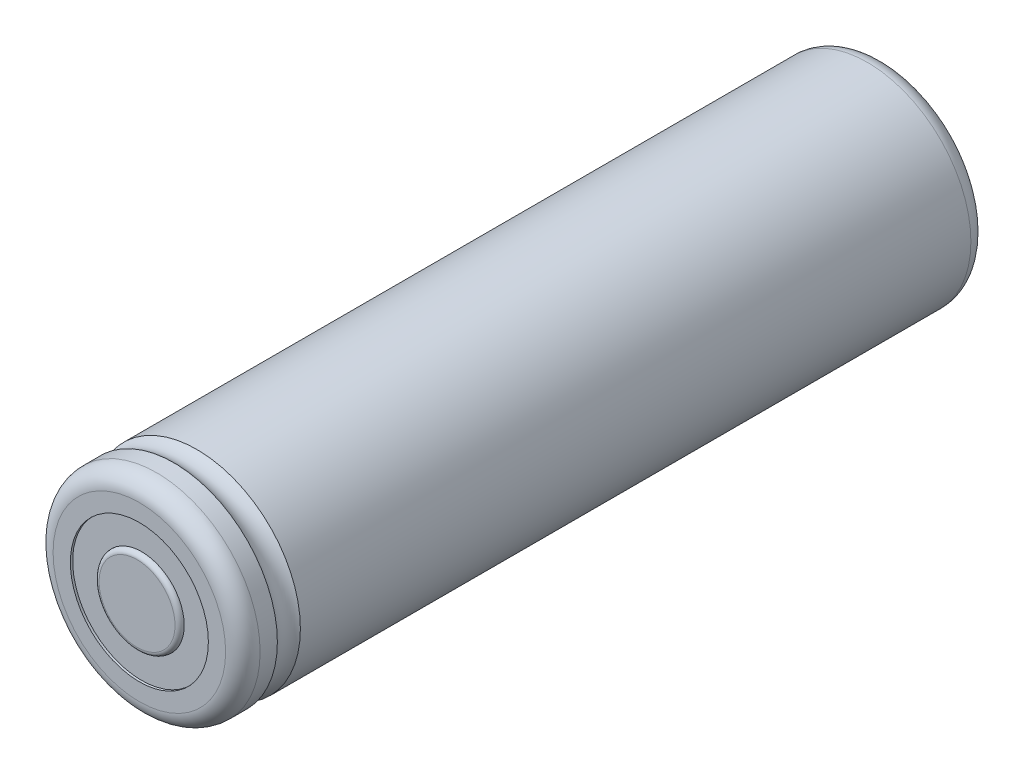
ISO-10303-21;
HEADER;
FILE_DESCRIPTION(('STEP AP214'),'2;1');
FILE_NAME('part.step','',(''),(''),'','','');
FILE_SCHEMA(('AUTOMOTIVE_DESIGN { 1 0 10303 214 1 1 1 1 }'));
ENDSEC;
DATA;
#1=APPLICATION_CONTEXT('core data for automotive mechanical design processes');
#2=APPLICATION_PROTOCOL_DEFINITION('international standard','automotive_design',2000,#1);
#3=PRODUCT_CONTEXT('',#1,'mechanical');
#4=PRODUCT('Part','Part','',(#3));
#5=PRODUCT_RELATED_PRODUCT_CATEGORY('part','',(#4));
#6=PRODUCT_DEFINITION_FORMATION('','',#4);
#7=PRODUCT_DEFINITION_CONTEXT('part definition',#1,'design');
#8=PRODUCT_DEFINITION('design','',#6,#7);
#9=PRODUCT_DEFINITION_SHAPE('','',#8);
#10=(LENGTH_UNIT() NAMED_UNIT(*) SI_UNIT(.MILLI.,.METRE.));
#11=(NAMED_UNIT(*) PLANE_ANGLE_UNIT() SI_UNIT($,.RADIAN.));
#12=(NAMED_UNIT(*) SI_UNIT($,.STERADIAN.) SOLID_ANGLE_UNIT());
#13=UNCERTAINTY_MEASURE_WITH_UNIT(LENGTH_MEASURE(1.E-05),#10,'distance_accuracy_value','');
#14=(GEOMETRIC_REPRESENTATION_CONTEXT(3) GLOBAL_UNCERTAINTY_ASSIGNED_CONTEXT((#13)) GLOBAL_UNIT_ASSIGNED_CONTEXT((#10,
#11,#12)) REPRESENTATION_CONTEXT('',''));
#15=CARTESIAN_POINT('',(0.,0.,0.));
#16=DIRECTION('',(0.,0.,1.));
#17=DIRECTION('',(1.,0.,0.));
#18=AXIS2_PLACEMENT_3D('',#15,#16,#17);
#19=CARTESIAN_POINT('',(0.,0.,0.));
#20=DIRECTION('',(0.,0.,-1.));
#21=DIRECTION('',(0.,-1.,0.));
#22=AXIS2_PLACEMENT_3D('',#19,#20,#21);
#23=PLANE('',#22);
#24=CARTESIAN_POINT('',(0.,0.,0.));
#25=DIRECTION('',(0.,0.,-1.));
#26=DIRECTION('',(1.,0.,0.));
#27=AXIS2_PLACEMENT_3D('',#24,#25,#26);
#28=CIRCLE('',#27,7.5);
#29=CARTESIAN_POINT('',(7.5,0.,0.));
#30=VERTEX_POINT('',#29);
#31=EDGE_CURVE('P0_E11',#30,#30,#28,.T.);
#32=ORIENTED_EDGE('',*,*,#31,.T.);
#33=EDGE_LOOP('',(#32));
#34=FACE_BOUND('',#33,.T.);
#35=CARTESIAN_POINT('',(0.,0.,0.));
#36=DIRECTION('',(0.,0.,-1.));
#37=DIRECTION('',(1.,0.,0.));
#38=AXIS2_PLACEMENT_3D('',#35,#36,#37);
#39=CIRCLE('',#38,6.);
#40=CARTESIAN_POINT('',(6.,0.,0.));
#41=VERTEX_POINT('',#40);
#42=EDGE_CURVE('P0_E28',#41,#41,#39,.T.);
#43=ORIENTED_EDGE('',*,*,#42,.F.);
#44=EDGE_LOOP('',(#43));
#45=FACE_BOUND('',#44,.T.);
#46=ADVANCED_FACE('P0_F17',(#34,#45),#23,.T.);
#47=CARTESIAN_POINT('',(0.,0.,0.));
#48=DIRECTION('',(0.,0.,1.));
#49=DIRECTION('',(1.,0.,0.));
#50=AXIS2_PLACEMENT_3D('',#47,#48,#49);
#51=CYLINDRICAL_SURFACE('',#50,6.);
#52=ORIENTED_EDGE('',*,*,#42,.T.);
#53=DIRECTION('',(0.,0.,1.));
#54=VECTOR('',#53,1.);
#55=CARTESIAN_POINT('',(6.,0.,0.));
#56=LINE('',#55,#54);
#57=CARTESIAN_POINT('',(6.,0.,64.8));
#58=VERTEX_POINT('',#57);
#59=EDGE_CURVE('P0_E71',#41,#58,#56,.T.);
#60=ORIENTED_EDGE('',*,*,#59,.T.);
#61=CARTESIAN_POINT('',(0.,0.,64.8));
#62=DIRECTION('',(0.,0.,-1.));
#63=DIRECTION('',(1.,0.,0.));
#64=AXIS2_PLACEMENT_3D('',#61,#62,#63);
#65=CIRCLE('',#64,6.);
#66=EDGE_CURVE('P0_E68',#58,#58,#65,.T.);
#67=ORIENTED_EDGE('',*,*,#66,.F.);
#68=ORIENTED_EDGE('',*,*,#59,.F.);
#69=EDGE_LOOP('',(#52,#60,#67,#68));
#70=FACE_BOUND('',#69,.T.);
#71=ADVANCED_FACE('P0_F70',(#70),#51,.F.);
#72=CARTESIAN_POINT('',(0.,0.,64.8));
#73=DIRECTION('',(0.,0.,-1.));
#74=DIRECTION('',(0.,-1.,0.));
#75=AXIS2_PLACEMENT_3D('',#72,#73,#74);
#76=PLANE('',#75);
#77=ORIENTED_EDGE('',*,*,#66,.T.);
#78=EDGE_LOOP('',(#77));
#79=FACE_BOUND('',#78,.T.);
#80=CARTESIAN_POINT('',(0.,0.,64.8));
#81=DIRECTION('',(0.,0.,-1.));
#82=DIRECTION('',(1.,0.,0.));
#83=AXIS2_PLACEMENT_3D('',#80,#81,#82);
#84=CIRCLE('',#83,7.5);
#85=CARTESIAN_POINT('',(7.5,0.,64.8));
#86=VERTEX_POINT('',#85);
#87=EDGE_CURVE('P0_E83',#86,#86,#84,.T.);
#88=ORIENTED_EDGE('',*,*,#87,.F.);
#89=EDGE_LOOP('',(#88));
#90=FACE_BOUND('',#89,.T.);
#91=ADVANCED_FACE('P0_F143',(#79,#90),#76,.F.);
#92=CARTESIAN_POINT('',(0.,0.,63.3));
#93=DIRECTION('',(0.,0.,1.));
#94=DIRECTION('',(1.,0.,0.));
#95=AXIS2_PLACEMENT_3D('',#92,#93,#94);
#96=TOROIDAL_SURFACE('',#95,7.5,1.5);
#97=CARTESIAN_POINT('',(7.5,0.,63.3));
#98=DIRECTION('',(0.,-1.,0.));
#99=DIRECTION('',(1.,0.,0.));
#100=AXIS2_PLACEMENT_3D('',#97,#98,#99);
#101=CIRCLE('',#100,1.5);
#102=CARTESIAN_POINT('',(9.000000000001,0.,63.3));
#103=VERTEX_POINT('',#102);
#104=EDGE_CURVE('P0_E74',#103,#86,#101,.T.);
#105=ORIENTED_EDGE('',*,*,#104,.T.);
#106=ORIENTED_EDGE('',*,*,#87,.T.);
#107=ORIENTED_EDGE('',*,*,#104,.F.);
#108=CARTESIAN_POINT('',(0.,0.,63.3));
#109=DIRECTION('',(0.,0.,-1.));
#110=DIRECTION('',(1.,0.,0.));
#111=AXIS2_PLACEMENT_3D('',#108,#109,#110);
#112=CIRCLE('',#111,9.000000000001);
#113=EDGE_CURVE('P0_E21',#103,#103,#112,.T.);
#114=ORIENTED_EDGE('',*,*,#113,.F.);
#115=EDGE_LOOP('',(#105,#106,#107,#114));
#116=FACE_BOUND('',#115,.T.);
#117=ADVANCED_FACE('P0_F141',(#116),#96,.T.);
#118=CARTESIAN_POINT('',(0.,0.,63.3));
#119=DIRECTION('',(0.,0.,-1.));
#120=DIRECTION('',(1.,0.,0.));
#121=AXIS2_PLACEMENT_3D('',#118,#119,#120);
#122=CYLINDRICAL_SURFACE('',#121,9.000000000001);
#123=ORIENTED_EDGE('',*,*,#113,.T.);
#124=DIRECTION('',(0.,0.,-1.));
#125=VECTOR('',#124,1.);
#126=CARTESIAN_POINT('',(9.000000000001,0.,63.3));
#127=LINE('',#126,#125);
#128=CARTESIAN_POINT('',(9.000000000001,0.,61.8));
#129=VERTEX_POINT('',#128);
#130=EDGE_CURVE('P0_E89',#103,#129,#127,.T.);
#131=ORIENTED_EDGE('',*,*,#130,.T.);
#132=CARTESIAN_POINT('',(0.,0.,61.8));
#133=DIRECTION('',(0.,0.,-1.));
#134=DIRECTION('',(1.,0.,0.));
#135=AXIS2_PLACEMENT_3D('',#132,#133,#134);
#136=CIRCLE('',#135,9.000000000001);
#137=EDGE_CURVE('P0_E86',#129,#129,#136,.T.);
#138=ORIENTED_EDGE('',*,*,#137,.F.);
#139=ORIENTED_EDGE('',*,*,#130,.F.);
#140=EDGE_LOOP('',(#123,#131,#138,#139));
#141=FACE_BOUND('',#140,.T.);
#142=ADVANCED_FACE('P0_F140',(#141),#122,.T.);
#143=CARTESIAN_POINT('',(0.,0.,60.8));
#144=DIRECTION('',(0.,0.,1.));
#145=DIRECTION('',(1.,0.,0.));
#146=AXIS2_PLACEMENT_3D('',#143,#144,#145);
#147=TOROIDAL_SURFACE('',#146,10.118033988751,1.5);
#148=ORIENTED_EDGE('',*,*,#137,.T.);
#149=CARTESIAN_POINT('',(10.118033988751,0.,60.8));
#150=DIRECTION('',(0.,-1.,0.));
#151=DIRECTION('',(1.,0.,0.));
#152=AXIS2_PLACEMENT_3D('',#149,#150,#151);
#153=CIRCLE('',#152,1.5);
#154=CARTESIAN_POINT('',(9.,0.,59.800000000001));
#155=VERTEX_POINT('',#154);
#156=EDGE_CURVE('P0_E90',#129,#155,#153,.T.);
#157=ORIENTED_EDGE('',*,*,#156,.T.);
#158=CARTESIAN_POINT('',(0.,0.,59.800000000001));
#159=DIRECTION('',(0.,0.,-1.));
#160=DIRECTION('',(1.,0.,0.));
#161=AXIS2_PLACEMENT_3D('',#158,#159,#160);
#162=CIRCLE('',#161,9.);
#163=EDGE_CURVE('P0_E100',#155,#155,#162,.T.);
#164=ORIENTED_EDGE('',*,*,#163,.F.);
#165=ORIENTED_EDGE('',*,*,#156,.F.);
#166=EDGE_LOOP('',(#148,#157,#164,#165));
#167=FACE_BOUND('',#166,.T.);
#168=ADVANCED_FACE('P0_F150',(#167),#147,.F.);
#169=CARTESIAN_POINT('',(0.,0.,59.800000000001));
#170=DIRECTION('',(0.,0.,-1.));
#171=DIRECTION('',(1.,0.,0.));
#172=AXIS2_PLACEMENT_3D('',#169,#170,#171);
#173=CYLINDRICAL_SURFACE('',#172,9.);
#174=ORIENTED_EDGE('',*,*,#163,.T.);
#175=DIRECTION('',(0.,0.,-1.));
#176=VECTOR('',#175,1.);
#177=CARTESIAN_POINT('',(9.,0.,59.800000000001));
#178=LINE('',#177,#176);
#179=CARTESIAN_POINT('',(9.,0.,1.5));
#180=VERTEX_POINT('',#179);
#181=EDGE_CURVE('P0_E107',#155,#180,#178,.T.);
#182=ORIENTED_EDGE('',*,*,#181,.T.);
#183=CARTESIAN_POINT('',(0.,0.,1.5));
#184=DIRECTION('',(0.,0.,-1.));
#185=DIRECTION('',(1.,0.,0.));
#186=AXIS2_PLACEMENT_3D('',#183,#184,#185);
#187=CIRCLE('',#186,9.);
#188=EDGE_CURVE('P0_E114',#180,#180,#187,.T.);
#189=ORIENTED_EDGE('',*,*,#188,.F.);
#190=ORIENTED_EDGE('',*,*,#181,.F.);
#191=EDGE_LOOP('',(#174,#182,#189,#190));
#192=FACE_BOUND('',#191,.T.);
#193=ADVANCED_FACE('P0_F19',(#192),#173,.T.);
#194=CARTESIAN_POINT('',(0.,0.,1.5));
#195=DIRECTION('',(0.,0.,1.));
#196=DIRECTION('',(1.,0.,0.));
#197=AXIS2_PLACEMENT_3D('',#194,#195,#196);
#198=TOROIDAL_SURFACE('',#197,7.5,1.5);
#199=CARTESIAN_POINT('',(7.5,0.,1.5));
#200=DIRECTION('',(0.,-1.,0.));
#201=DIRECTION('',(1.,0.,0.));
#202=AXIS2_PLACEMENT_3D('',#199,#200,#201);
#203=CIRCLE('',#202,1.5);
#204=EDGE_CURVE('P0_E111',#30,#180,#203,.T.);
#205=ORIENTED_EDGE('',*,*,#204,.T.);
#206=ORIENTED_EDGE('',*,*,#188,.T.);
#207=ORIENTED_EDGE('',*,*,#204,.F.);
#208=ORIENTED_EDGE('',*,*,#31,.F.);
#209=EDGE_LOOP('',(#205,#206,#207,#208));
#210=FACE_BOUND('',#209,.T.);
#211=ADVANCED_FACE('P0_F121',(#210),#198,.T.);
#212=CLOSED_SHELL('',(#46,#71,#91,#117,#142,#168,#193,#211));
#213=MANIFOLD_SOLID_BREP('P0_B1',#212);
#214=CARTESIAN_POINT('',(0.,0.,0.4));
#215=DIRECTION('',(0.,0.,-1.));
#216=DIRECTION('',(0.,-1.,0.));
#217=AXIS2_PLACEMENT_3D('',#214,#215,#216);
#218=PLANE('',#217);
#219=CARTESIAN_POINT('',(0.,0.,0.4));
#220=DIRECTION('',(0.,0.,-1.));
#221=DIRECTION('',(1.,0.,0.));
#222=AXIS2_PLACEMENT_3D('',#219,#220,#221);
#223=CIRCLE('',#222,6.);
#224=CARTESIAN_POINT('',(6.,0.,0.4));
#225=VERTEX_POINT('',#224);
#226=EDGE_CURVE('P1_E11',#225,#225,#223,.T.);
#227=ORIENTED_EDGE('',*,*,#226,.T.);
#228=EDGE_LOOP('',(#227));
#229=FACE_BOUND('',#228,.T.);
#230=ADVANCED_FACE('P1_F17',(#229),#218,.T.);
#231=CARTESIAN_POINT('',(0.,0.,0.4));
#232=DIRECTION('',(0.,0.,1.));
#233=DIRECTION('',(1.,0.,0.));
#234=AXIS2_PLACEMENT_3D('',#231,#232,#233);
#235=CYLINDRICAL_SURFACE('',#234,6.);
#236=DIRECTION('',(0.,0.,1.));
#237=VECTOR('',#236,1.);
#238=CARTESIAN_POINT('',(6.,0.,0.4));
#239=LINE('',#238,#237);
#240=CARTESIAN_POINT('',(6.,0.,64.2));
#241=VERTEX_POINT('',#240);
#242=EDGE_CURVE('P1_E27',#225,#241,#239,.T.);
#243=ORIENTED_EDGE('',*,*,#242,.T.);
#244=CARTESIAN_POINT('',(0.,0.,64.2));
#245=DIRECTION('',(0.,0.,-1.));
#246=DIRECTION('',(1.,0.,0.));
#247=AXIS2_PLACEMENT_3D('',#244,#245,#246);
#248=CIRCLE('',#247,6.);
#249=EDGE_CURVE('P1_E79',#241,#241,#248,.T.);
#250=ORIENTED_EDGE('',*,*,#249,.T.);
#251=ORIENTED_EDGE('',*,*,#242,.F.);
#252=ORIENTED_EDGE('',*,*,#226,.F.);
#253=EDGE_LOOP('',(#243,#250,#251,#252));
#254=FACE_BOUND('',#253,.T.);
#255=ADVANCED_FACE('P1_F92',(#254),#235,.T.);
#256=CARTESIAN_POINT('',(0.,0.,64.2));
#257=DIRECTION('',(0.,0.,-1.));
#258=DIRECTION('',(0.,-1.,0.));
#259=AXIS2_PLACEMENT_3D('',#256,#257,#258);
#260=PLANE('',#259);
#261=ORIENTED_EDGE('',*,*,#249,.F.);
#262=EDGE_LOOP('',(#261));
#263=FACE_BOUND('',#262,.T.);
#264=CARTESIAN_POINT('',(0.,0.,64.2));
#265=DIRECTION('',(0.,0.,-1.));
#266=DIRECTION('',(1.,0.,0.));
#267=AXIS2_PLACEMENT_3D('',#264,#265,#266);
#268=CIRCLE('',#267,3.7);
#269=CARTESIAN_POINT('',(3.7,0.,64.2));
#270=VERTEX_POINT('',#269);
#271=EDGE_CURVE('P1_E72',#270,#270,#268,.T.);
#272=ORIENTED_EDGE('',*,*,#271,.T.);
#273=EDGE_LOOP('',(#272));
#274=FACE_BOUND('',#273,.T.);
#275=ADVANCED_FACE('P1_F94',(#263,#274),#260,.F.);
#276=CARTESIAN_POINT('',(0.,0.,64.2));
#277=DIRECTION('',(0.,0.,1.));
#278=DIRECTION('',(1.,0.,0.));
#279=AXIS2_PLACEMENT_3D('',#276,#277,#278);
#280=CYLINDRICAL_SURFACE('',#279,3.7);
#281=DIRECTION('',(0.,0.,1.));
#282=VECTOR('',#281,1.);
#283=CARTESIAN_POINT('',(3.7,0.,64.2));
#284=LINE('',#283,#282);
#285=CARTESIAN_POINT('',(3.7,0.,64.6));
#286=VERTEX_POINT('',#285);
#287=EDGE_CURVE('P1_E66',#270,#286,#284,.T.);
#288=ORIENTED_EDGE('',*,*,#287,.T.);
#289=CARTESIAN_POINT('',(0.,0.,64.6));
#290=DIRECTION('',(0.,0.,-1.));
#291=DIRECTION('',(1.,0.,0.));
#292=AXIS2_PLACEMENT_3D('',#289,#290,#291);
#293=CIRCLE('',#292,3.7);
#294=EDGE_CURVE('P1_E20',#286,#286,#293,.T.);
#295=ORIENTED_EDGE('',*,*,#294,.T.);
#296=ORIENTED_EDGE('',*,*,#287,.F.);
#297=ORIENTED_EDGE('',*,*,#271,.F.);
#298=EDGE_LOOP('',(#288,#295,#296,#297));
#299=FACE_BOUND('',#298,.T.);
#300=ADVANCED_FACE('P1_F96',(#299),#280,.T.);
#301=CARTESIAN_POINT('',(0.,0.,64.6));
#302=DIRECTION('',(0.,0.,1.));
#303=DIRECTION('',(1.,0.,0.));
#304=AXIS2_PLACEMENT_3D('',#301,#302,#303);
#305=TOROIDAL_SURFACE('',#304,3.3,0.4);
#306=CARTESIAN_POINT('',(3.3,0.,64.6));
#307=DIRECTION('',(0.,-1.,0.));
#308=DIRECTION('',(1.,0.,0.));
#309=AXIS2_PLACEMENT_3D('',#306,#307,#308);
#310=CIRCLE('',#309,0.4);
#311=CARTESIAN_POINT('',(3.3,0.,65.));
#312=VERTEX_POINT('',#311);
#313=EDGE_CURVE('P1_E61',#286,#312,#310,.T.);
#314=ORIENTED_EDGE('',*,*,#313,.T.);
#315=CARTESIAN_POINT('',(0.,0.,65.));
#316=DIRECTION('',(0.,0.,-1.));
#317=DIRECTION('',(1.,0.,0.));
#318=AXIS2_PLACEMENT_3D('',#315,#316,#317);
#319=CIRCLE('',#318,3.3);
#320=EDGE_CURVE('P1_E52',#312,#312,#319,.T.);
#321=ORIENTED_EDGE('',*,*,#320,.T.);
#322=ORIENTED_EDGE('',*,*,#313,.F.);
#323=ORIENTED_EDGE('',*,*,#294,.F.);
#324=EDGE_LOOP('',(#314,#321,#322,#323));
#325=FACE_BOUND('',#324,.T.);
#326=ADVANCED_FACE('P1_F60',(#325),#305,.T.);
#327=CARTESIAN_POINT('',(0.,0.,65.));
#328=DIRECTION('',(0.,0.,-1.));
#329=DIRECTION('',(0.,-1.,0.));
#330=AXIS2_PLACEMENT_3D('',#327,#328,#329);
#331=PLANE('',#330);
#332=ORIENTED_EDGE('',*,*,#320,.F.);
#333=EDGE_LOOP('',(#332));
#334=FACE_BOUND('',#333,.T.);
#335=ADVANCED_FACE('P1_F142',(#334),#331,.F.);
#336=CLOSED_SHELL('',(#230,#255,#275,#300,#326,#335));
#337=MANIFOLD_SOLID_BREP('P1_B1',#336);
#338=CARTESIAN_POINT('',(0.,0.,64.2));
#339=DIRECTION('',(0.,0.,-1.));
#340=DIRECTION('',(-1.,0.,0.));
#341=AXIS2_PLACEMENT_3D('',#338,#339,#340);
#342=PLANE('',#341);
#343=CARTESIAN_POINT('',(0.,0.,64.2));
#344=DIRECTION('',(0.,0.,-1.));
#345=DIRECTION('',(1.,0.,0.));
#346=AXIS2_PLACEMENT_3D('',#343,#344,#345);
#347=CIRCLE('',#346,3.7);
#348=CARTESIAN_POINT('',(3.7,0.,64.2));
#349=VERTEX_POINT('',#348);
#350=EDGE_CURVE('P2_E38',#349,#349,#347,.T.);
#351=ORIENTED_EDGE('',*,*,#350,.F.);
#352=EDGE_LOOP('',(#351));
#353=FACE_BOUND('',#352,.T.);
#354=CARTESIAN_POINT('',(0.,0.,64.2));
#355=DIRECTION('',(0.,0.,-1.));
#356=DIRECTION('',(1.,0.,0.));
#357=AXIS2_PLACEMENT_3D('',#354,#355,#356);
#358=CIRCLE('',#357,6.);
#359=CARTESIAN_POINT('',(6.,0.,64.2));
#360=VERTEX_POINT('',#359);
#361=EDGE_CURVE('P2_E10',#360,#360,#358,.T.);
#362=ORIENTED_EDGE('',*,*,#361,.T.);
#363=EDGE_LOOP('',(#362));
#364=FACE_BOUND('',#363,.T.);
#365=ADVANCED_FACE('P2_F16',(#353,#364),#342,.T.);
#366=CARTESIAN_POINT('',(0.,0.,64.2));
#367=DIRECTION('',(0.,0.,1.));
#368=DIRECTION('',(1.,0.,0.));
#369=AXIS2_PLACEMENT_3D('',#366,#367,#368);
#370=CYLINDRICAL_SURFACE('',#369,6.);
#371=DIRECTION('',(0.,0.,1.));
#372=VECTOR('',#371,1.);
#373=CARTESIAN_POINT('',(6.,0.,64.2));
#374=LINE('',#373,#372);
#375=CARTESIAN_POINT('',(6.,0.,64.6));
#376=VERTEX_POINT('',#375);
#377=EDGE_CURVE('P2_E27',#360,#376,#374,.T.);
#378=ORIENTED_EDGE('',*,*,#377,.T.);
#379=CARTESIAN_POINT('',(0.,0.,64.6));
#380=DIRECTION('',(0.,0.,-1.));
#381=DIRECTION('',(1.,0.,0.));
#382=AXIS2_PLACEMENT_3D('',#379,#380,#381);
#383=CIRCLE('',#382,6.);
#384=EDGE_CURVE('P2_E47',#376,#376,#383,.T.);
#385=ORIENTED_EDGE('',*,*,#384,.T.);
#386=ORIENTED_EDGE('',*,*,#377,.F.);
#387=ORIENTED_EDGE('',*,*,#361,.F.);
#388=EDGE_LOOP('',(#378,#385,#386,#387));
#389=FACE_BOUND('',#388,.T.);
#390=ADVANCED_FACE('P2_F18',(#389),#370,.T.);
#391=CARTESIAN_POINT('',(0.,0.,64.6));
#392=DIRECTION('',(0.,0.,-1.));
#393=DIRECTION('',(-1.,0.,0.));
#394=AXIS2_PLACEMENT_3D('',#391,#392,#393);
#395=PLANE('',#394);
#396=ORIENTED_EDGE('',*,*,#384,.F.);
#397=EDGE_LOOP('',(#396));
#398=FACE_BOUND('',#397,.T.);
#399=CARTESIAN_POINT('',(0.,0.,64.6));
#400=DIRECTION('',(0.,0.,-1.));
#401=DIRECTION('',(1.,0.,0.));
#402=AXIS2_PLACEMENT_3D('',#399,#400,#401);
#403=CIRCLE('',#402,3.7);
#404=CARTESIAN_POINT('',(3.7,0.,64.6));
#405=VERTEX_POINT('',#404);
#406=EDGE_CURVE('P2_E57',#405,#405,#403,.T.);
#407=ORIENTED_EDGE('',*,*,#406,.T.);
#408=EDGE_LOOP('',(#407));
#409=FACE_BOUND('',#408,.T.);
#410=ADVANCED_FACE('P2_F85',(#398,#409),#395,.F.);
#411=CARTESIAN_POINT('',(0.,0.,64.6));
#412=DIRECTION('',(0.,0.,-1.));
#413=DIRECTION('',(1.,0.,0.));
#414=AXIS2_PLACEMENT_3D('',#411,#412,#413);
#415=CYLINDRICAL_SURFACE('',#414,3.7);
#416=DIRECTION('',(0.,0.,-1.));
#417=VECTOR('',#416,1.);
#418=CARTESIAN_POINT('',(3.7,0.,64.6));
#419=LINE('',#418,#417);
#420=EDGE_CURVE('P2_E20',#405,#349,#419,.T.);
#421=ORIENTED_EDGE('',*,*,#420,.T.);
#422=ORIENTED_EDGE('',*,*,#350,.T.);
#423=ORIENTED_EDGE('',*,*,#420,.F.);
#424=ORIENTED_EDGE('',*,*,#406,.F.);
#425=EDGE_LOOP('',(#421,#422,#423,#424));
#426=FACE_BOUND('',#425,.T.);
#427=ADVANCED_FACE('P2_F58',(#426),#415,.F.);
#428=CLOSED_SHELL('',(#365,#390,#410,#427));
#429=MANIFOLD_SOLID_BREP('P2_B1',#428);
#430=ADVANCED_BREP_SHAPE_REPRESENTATION('',(#18,#213,#337,#429),#14);
#431=SHAPE_DEFINITION_REPRESENTATION(#9,#430);
ENDSEC;
END-ISO-10303-21;
